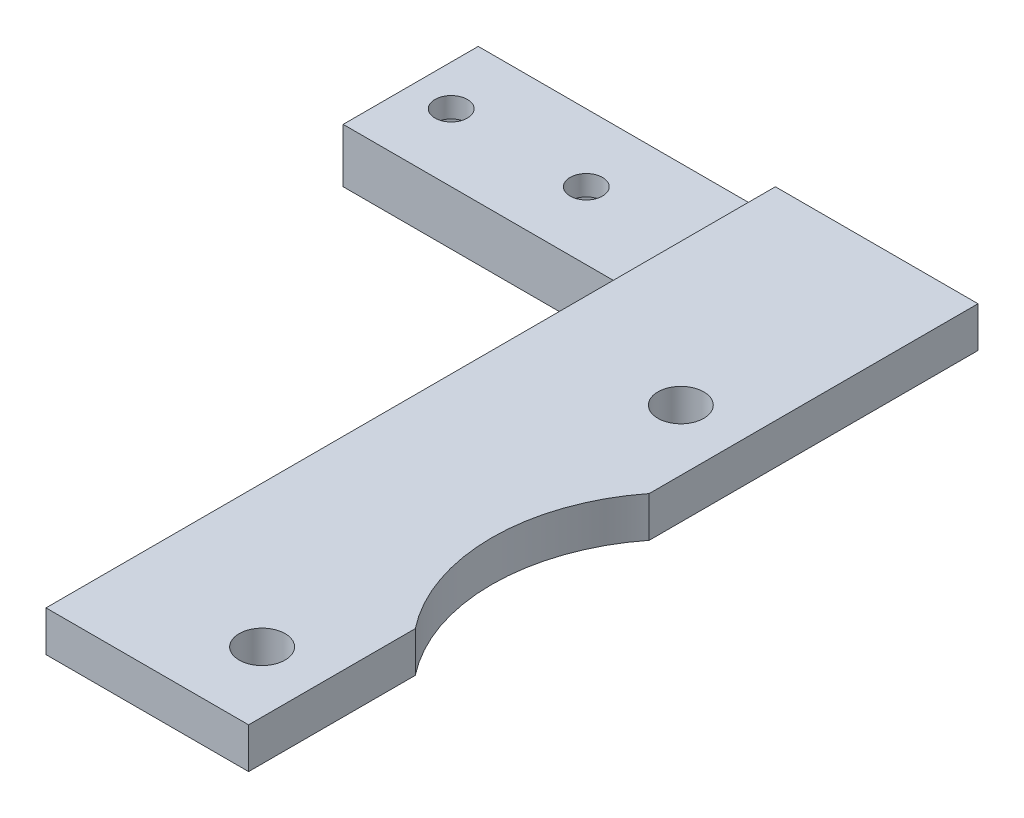
ISO-10303-21;
HEADER;
FILE_DESCRIPTION(('STEP AP214'),'2;1');
FILE_NAME('part.step','',(''),(''),'','','');
FILE_SCHEMA(('AUTOMOTIVE_DESIGN { 1 0 10303 214 1 1 1 1 }'));
ENDSEC;
DATA;
#1=APPLICATION_CONTEXT('core data for automotive mechanical design processes');
#2=APPLICATION_PROTOCOL_DEFINITION('international standard','automotive_design',2000,#1);
#3=PRODUCT_CONTEXT('',#1,'mechanical');
#4=PRODUCT('Part','Part','',(#3));
#5=PRODUCT_RELATED_PRODUCT_CATEGORY('part','',(#4));
#6=PRODUCT_DEFINITION_FORMATION('','',#4);
#7=PRODUCT_DEFINITION_CONTEXT('part definition',#1,'design');
#8=PRODUCT_DEFINITION('design','',#6,#7);
#9=PRODUCT_DEFINITION_SHAPE('','',#8);
#10=(LENGTH_UNIT() NAMED_UNIT(*) SI_UNIT(.MILLI.,.METRE.));
#11=(NAMED_UNIT(*) PLANE_ANGLE_UNIT() SI_UNIT($,.RADIAN.));
#12=(NAMED_UNIT(*) SI_UNIT($,.STERADIAN.) SOLID_ANGLE_UNIT());
#13=UNCERTAINTY_MEASURE_WITH_UNIT(LENGTH_MEASURE(1.E-05),#10,'distance_accuracy_value','');
#14=(GEOMETRIC_REPRESENTATION_CONTEXT(3) GLOBAL_UNCERTAINTY_ASSIGNED_CONTEXT((#13)) GLOBAL_UNIT_ASSIGNED_CONTEXT((#10,
#11,#12)) REPRESENTATION_CONTEXT('',''));
#15=CARTESIAN_POINT('',(0.,0.,0.));
#16=DIRECTION('',(0.,0.,1.));
#17=DIRECTION('',(1.,0.,0.));
#18=AXIS2_PLACEMENT_3D('',#15,#16,#17);
#19=CARTESIAN_POINT('',(3.,-1.,5.));
#20=DIRECTION('',(0.,1.,0.));
#21=DIRECTION('',(0.,0.,1.));
#22=AXIS2_PLACEMENT_3D('',#19,#20,#21);
#23=CYLINDRICAL_SURFACE('',#22,1.2);
#24=CARTESIAN_POINT('',(3.,4.,5.));
#25=DIRECTION('',(0.,1.,0.));
#26=DIRECTION('',(0.,0.,1.));
#27=AXIS2_PLACEMENT_3D('',#24,#25,#26);
#28=CIRCLE('',#27,1.2);
#29=CARTESIAN_POINT('',(3.,4.,6.2));
#30=VERTEX_POINT('',#29);
#31=EDGE_CURVE('E358',#30,#30,#28,.T.);
#32=ORIENTED_EDGE('',*,*,#31,.T.);
#33=EDGE_LOOP('',(#32));
#34=FACE_BOUND('',#33,.T.);
#35=CARTESIAN_POINT('',(3.,2.5,5.));
#36=DIRECTION('',(0.,-1.,0.));
#37=DIRECTION('',(0.,0.,-1.));
#38=AXIS2_PLACEMENT_3D('',#35,#36,#37);
#39=CIRCLE('',#38,1.2);
#40=CARTESIAN_POINT('',(3.,2.5,3.8));
#41=VERTEX_POINT('',#40);
#42=EDGE_CURVE('E43',#41,#41,#39,.F.);
#43=ORIENTED_EDGE('',*,*,#42,.F.);
#44=EDGE_LOOP('',(#43));
#45=FACE_BOUND('',#44,.T.);
#46=ADVANCED_FACE('F39',(#34,#45),#23,.F.);
#47=CARTESIAN_POINT('',(13.,-1.,5.));
#48=DIRECTION('',(0.,1.,0.));
#49=DIRECTION('',(0.,0.,1.));
#50=AXIS2_PLACEMENT_3D('',#47,#48,#49);
#51=CYLINDRICAL_SURFACE('',#50,1.2);
#52=CARTESIAN_POINT('',(13.,4.,5.));
#53=DIRECTION('',(0.,1.,0.));
#54=DIRECTION('',(0.,0.,1.));
#55=AXIS2_PLACEMENT_3D('',#52,#53,#54);
#56=CIRCLE('',#55,1.2);
#57=CARTESIAN_POINT('',(13.,4.,6.2));
#58=VERTEX_POINT('',#57);
#59=EDGE_CURVE('E353',#58,#58,#56,.T.);
#60=ORIENTED_EDGE('',*,*,#59,.T.);
#61=EDGE_LOOP('',(#60));
#62=FACE_BOUND('',#61,.T.);
#63=CARTESIAN_POINT('',(13.,2.5,5.));
#64=DIRECTION('',(0.,-1.,0.));
#65=DIRECTION('',(0.,0.,-1.));
#66=AXIS2_PLACEMENT_3D('',#63,#64,#65);
#67=CIRCLE('',#66,1.2);
#68=CARTESIAN_POINT('',(13.,2.5,3.8));
#69=VERTEX_POINT('',#68);
#70=EDGE_CURVE('E278',#69,#69,#67,.F.);
#71=ORIENTED_EDGE('',*,*,#70,.F.);
#72=EDGE_LOOP('',(#71));
#73=FACE_BOUND('',#72,.T.);
#74=ADVANCED_FACE('F527',(#62,#73),#51,.F.);
#75=CARTESIAN_POINT('',(37.,3.00000000000001,10.));
#76=DIRECTION('',(-1.,0.,0.));
#77=DIRECTION('',(0.,0.,1.));
#78=AXIS2_PLACEMENT_3D('',#75,#76,#77);
#79=PLANE('',#78);
#80=DIRECTION('',(0.,0.,-1.));
#81=VECTOR('',#80,1.);
#82=CARTESIAN_POINT('',(37.,3.00000000000001,10.));
#83=LINE('',#82,#81);
#84=CARTESIAN_POINT('',(37.,3.00000000000001,54.));
#85=VERTEX_POINT('',#84);
#86=CARTESIAN_POINT('',(37.,3.,41.6602540378444));
#87=VERTEX_POINT('',#86);
#88=EDGE_CURVE('E492',#85,#87,#83,.T.);
#89=ORIENTED_EDGE('',*,*,#88,.T.);
#90=DIRECTION('',(0.,1.,0.));
#91=VECTOR('',#90,1.);
#92=CARTESIAN_POINT('',(37.,-38.,41.6602540378444));
#93=LINE('',#92,#91);
#94=CARTESIAN_POINT('',(37.,6.00000000000001,41.6602540378444));
#95=VERTEX_POINT('',#94);
#96=EDGE_CURVE('E377',#87,#95,#93,.T.);
#97=ORIENTED_EDGE('',*,*,#96,.T.);
#98=DIRECTION('',(0.,0.,-1.));
#99=VECTOR('',#98,1.);
#100=CARTESIAN_POINT('',(37.,6.00000000000001,10.));
#101=LINE('',#100,#99);
#102=CARTESIAN_POINT('',(37.,6.,54.));
#103=VERTEX_POINT('',#102);
#104=EDGE_CURVE('E487',#103,#95,#101,.T.);
#105=ORIENTED_EDGE('',*,*,#104,.F.);
#106=DIRECTION('',(0.,1.,0.));
#107=VECTOR('',#106,1.);
#108=CARTESIAN_POINT('',(37.,3.00000000000001,54.));
#109=LINE('',#108,#107);
#110=EDGE_CURVE('E390',#85,#103,#109,.T.);
#111=ORIENTED_EDGE('',*,*,#110,.F.);
#112=EDGE_LOOP('',(#89,#97,#105,#111));
#113=FACE_BOUND('',#112,.T.);
#114=ADVANCED_FACE('F533',(#113),#79,.F.);
#115=CARTESIAN_POINT('',(21.,5.,10.));
#116=DIRECTION('',(0.,0.,-1.));
#117=DIRECTION('',(-1.,0.,0.));
#118=AXIS2_PLACEMENT_3D('',#115,#116,#117);
#119=PLANE('',#118);
#120=DIRECTION('',(1.,0.,0.));
#121=VECTOR('',#120,1.);
#122=CARTESIAN_POINT('',(37.,3.00000000000001,10.));
#123=LINE('',#122,#121);
#124=CARTESIAN_POINT('',(22.,3.,10.));
#125=VERTEX_POINT('',#124);
#126=CARTESIAN_POINT('',(26.,3.00000000000001,10.));
#127=VERTEX_POINT('',#126);
#128=EDGE_CURVE('E389',#125,#127,#123,.T.);
#129=ORIENTED_EDGE('',*,*,#128,.F.);
#130=DIRECTION('',(0.,-1.,0.));
#131=VECTOR('',#130,1.);
#132=CARTESIAN_POINT('',(22.,3.,10.));
#133=LINE('',#132,#131);
#134=CARTESIAN_POINT('',(22.,5.,10.));
#135=VERTEX_POINT('',#134);
#136=EDGE_CURVE('E49',#135,#125,#133,.T.);
#137=ORIENTED_EDGE('',*,*,#136,.F.);
#138=CARTESIAN_POINT('',(21.,5.,10.));
#139=DIRECTION('',(0.,0.,-1.));
#140=DIRECTION('',(-1.,0.,0.));
#141=AXIS2_PLACEMENT_3D('',#138,#139,#140);
#142=CIRCLE('',#141,1.);
#143=CARTESIAN_POINT('',(21.,4.,10.));
#144=VERTEX_POINT('',#143);
#145=EDGE_CURVE('E437',#135,#144,#142,.T.);
#146=ORIENTED_EDGE('',*,*,#145,.T.);
#147=DIRECTION('',(-1.,0.,0.));
#148=VECTOR('',#147,1.);
#149=CARTESIAN_POINT('',(0.,4.,10.));
#150=LINE('',#149,#148);
#151=CARTESIAN_POINT('',(0.,4.,10.));
#152=VERTEX_POINT('',#151);
#153=EDGE_CURVE('E417',#144,#152,#150,.T.);
#154=ORIENTED_EDGE('',*,*,#153,.T.);
#155=DIRECTION('',(0.,-1.,0.));
#156=VECTOR('',#155,1.);
#157=CARTESIAN_POINT('',(0.,4.,10.));
#158=LINE('',#157,#156);
#159=CARTESIAN_POINT('',(0.,0.,10.));
#160=VERTEX_POINT('',#159);
#161=EDGE_CURVE('E421',#152,#160,#158,.T.);
#162=ORIENTED_EDGE('',*,*,#161,.T.);
#163=DIRECTION('',(1.,0.,0.));
#164=VECTOR('',#163,1.);
#165=CARTESIAN_POINT('',(0.,0.,10.));
#166=LINE('',#165,#164);
#167=CARTESIAN_POINT('',(24.,0.,10.));
#168=VERTEX_POINT('',#167);
#169=EDGE_CURVE('E425',#160,#168,#166,.T.);
#170=ORIENTED_EDGE('',*,*,#169,.T.);
#171=CARTESIAN_POINT('',(24.,1.,10.));
#172=DIRECTION('',(0.,0.,1.));
#173=DIRECTION('',(-1.,0.,0.));
#174=AXIS2_PLACEMENT_3D('',#171,#172,#173);
#175=CIRCLE('',#174,1.);
#176=CARTESIAN_POINT('',(25.,1.,10.));
#177=VERTEX_POINT('',#176);
#178=EDGE_CURVE('E428',#168,#177,#175,.T.);
#179=ORIENTED_EDGE('',*,*,#178,.T.);
#180=DIRECTION('',(0.,1.,0.));
#181=VECTOR('',#180,1.);
#182=CARTESIAN_POINT('',(25.,1.,10.));
#183=LINE('',#182,#181);
#184=CARTESIAN_POINT('',(25.,2.00000000000001,10.));
#185=VERTEX_POINT('',#184);
#186=EDGE_CURVE('E431',#177,#185,#183,.T.);
#187=ORIENTED_EDGE('',*,*,#186,.T.);
#188=CARTESIAN_POINT('',(26.,2.00000000000001,10.));
#189=DIRECTION('',(0.,0.,-1.));
#190=DIRECTION('',(-1.,0.,0.));
#191=AXIS2_PLACEMENT_3D('',#188,#189,#190);
#192=CIRCLE('',#191,1.);
#193=EDGE_CURVE('E434',#185,#127,#192,.T.);
#194=ORIENTED_EDGE('',*,*,#193,.T.);
#195=EDGE_LOOP('',(#129,#137,#146,#154,#162,#170,#179,#187,#194));
#196=FACE_BOUND('',#195,.T.);
#197=ADVANCED_FACE('F556',(#196),#119,.F.);
#198=CARTESIAN_POINT('',(0.,4.,10.));
#199=DIRECTION('',(0.,-1.,0.));
#200=DIRECTION('',(0.,0.,-1.));
#201=AXIS2_PLACEMENT_3D('',#198,#199,#200);
#202=PLANE('',#201);
#203=ORIENTED_EDGE('',*,*,#59,.F.);
#204=EDGE_LOOP('',(#203));
#205=FACE_BOUND('',#204,.T.);
#206=ORIENTED_EDGE('',*,*,#31,.F.);
#207=EDGE_LOOP('',(#206));
#208=FACE_BOUND('',#207,.T.);
#209=DIRECTION('',(-1.,0.,0.));
#210=VECTOR('',#209,1.);
#211=CARTESIAN_POINT('',(0.,4.,0.));
#212=LINE('',#211,#210);
#213=CARTESIAN_POINT('',(21.,4.,0.));
#214=VERTEX_POINT('',#213);
#215=CARTESIAN_POINT('',(0.,4.,0.));
#216=VERTEX_POINT('',#215);
#217=EDGE_CURVE('E416',#214,#216,#212,.T.);
#218=ORIENTED_EDGE('',*,*,#217,.T.);
#219=DIRECTION('',(0.,0.,-1.));
#220=VECTOR('',#219,1.);
#221=CARTESIAN_POINT('',(0.,4.,10.));
#222=LINE('',#221,#220);
#223=EDGE_CURVE('E409',#152,#216,#222,.T.);
#224=ORIENTED_EDGE('',*,*,#223,.F.);
#225=ORIENTED_EDGE('',*,*,#153,.F.);
#226=DIRECTION('',(0.,0.,-1.));
#227=VECTOR('',#226,1.);
#228=CARTESIAN_POINT('',(21.,4.,10.));
#229=LINE('',#228,#227);
#230=EDGE_CURVE('E440',#144,#214,#229,.T.);
#231=ORIENTED_EDGE('',*,*,#230,.T.);
#232=EDGE_LOOP('',(#218,#224,#225,#231));
#233=FACE_BOUND('',#232,.T.);
#234=ADVANCED_FACE('F41',(#205,#208,#233),#202,.F.);
#235=CARTESIAN_POINT('',(0.,4.,10.));
#236=DIRECTION('',(1.,0.,0.));
#237=DIRECTION('',(0.,1.,0.));
#238=AXIS2_PLACEMENT_3D('',#235,#236,#237);
#239=PLANE('',#238);
#240=DIRECTION('',(0.,-1.,0.));
#241=VECTOR('',#240,1.);
#242=CARTESIAN_POINT('',(0.,4.,0.));
#243=LINE('',#242,#241);
#244=CARTESIAN_POINT('',(0.,0.,0.));
#245=VERTEX_POINT('',#244);
#246=EDGE_CURVE('E444',#216,#245,#243,.T.);
#247=ORIENTED_EDGE('',*,*,#246,.T.);
#248=DIRECTION('',(0.,0.,-1.));
#249=VECTOR('',#248,1.);
#250=CARTESIAN_POINT('',(0.,0.,10.));
#251=LINE('',#250,#249);
#252=EDGE_CURVE('E512',#160,#245,#251,.T.);
#253=ORIENTED_EDGE('',*,*,#252,.F.);
#254=ORIENTED_EDGE('',*,*,#161,.F.);
#255=ORIENTED_EDGE('',*,*,#223,.T.);
#256=EDGE_LOOP('',(#247,#253,#254,#255));
#257=FACE_BOUND('',#256,.T.);
#258=ADVANCED_FACE('F597',(#257),#239,.F.);
#259=CARTESIAN_POINT('',(0.,0.,10.));
#260=DIRECTION('',(0.,1.,0.));
#261=DIRECTION('',(0.,0.,1.));
#262=AXIS2_PLACEMENT_3D('',#259,#260,#261);
#263=PLANE('',#262);
#264=DIRECTION('',(-0.866025403784438,0.,-0.5));
#265=VECTOR('',#264,1.);
#266=CARTESIAN_POINT('',(3.,0.,7.25));
#267=LINE('',#266,#265);
#268=CARTESIAN_POINT('',(3.,0.,7.25));
#269=VERTEX_POINT('',#268);
#270=CARTESIAN_POINT('',(1.05144284148501,0.,6.125));
#271=VERTEX_POINT('',#270);
#272=EDGE_CURVE('E260',#269,#271,#267,.T.);
#273=ORIENTED_EDGE('',*,*,#272,.F.);
#274=DIRECTION('',(-0.866025403784438,0.,0.5));
#275=VECTOR('',#274,1.);
#276=CARTESIAN_POINT('',(4.94855715851499,0.,6.125));
#277=LINE('',#276,#275);
#278=CARTESIAN_POINT('',(4.94855715851499,0.,6.125));
#279=VERTEX_POINT('',#278);
#280=EDGE_CURVE('E57',#279,#269,#277,.T.);
#281=ORIENTED_EDGE('',*,*,#280,.F.);
#282=DIRECTION('',(0.,0.,1.));
#283=VECTOR('',#282,1.);
#284=CARTESIAN_POINT('',(4.94855715851499,0.,3.875));
#285=LINE('',#284,#283);
#286=CARTESIAN_POINT('',(4.94855715851499,0.,3.875));
#287=VERTEX_POINT('',#286);
#288=EDGE_CURVE('E240',#287,#279,#285,.T.);
#289=ORIENTED_EDGE('',*,*,#288,.F.);
#290=DIRECTION('',(0.866025403784439,0.,0.5));
#291=VECTOR('',#290,1.);
#292=CARTESIAN_POINT('',(3.,0.,2.75));
#293=LINE('',#292,#291);
#294=CARTESIAN_POINT('',(3.,0.,2.75));
#295=VERTEX_POINT('',#294);
#296=EDGE_CURVE('E244',#295,#287,#293,.T.);
#297=ORIENTED_EDGE('',*,*,#296,.F.);
#298=DIRECTION('',(0.866025403784438,0.,-0.5));
#299=VECTOR('',#298,1.);
#300=CARTESIAN_POINT('',(1.05144284148501,0.,3.875));
#301=LINE('',#300,#299);
#302=CARTESIAN_POINT('',(1.05144284148501,0.,3.875));
#303=VERTEX_POINT('',#302);
#304=EDGE_CURVE('E268',#303,#295,#301,.T.);
#305=ORIENTED_EDGE('',*,*,#304,.F.);
#306=DIRECTION('',(0.,0.,-1.));
#307=VECTOR('',#306,1.);
#308=CARTESIAN_POINT('',(1.05144284148501,0.,6.125));
#309=LINE('',#308,#307);
#310=EDGE_CURVE('E264',#271,#303,#309,.T.);
#311=ORIENTED_EDGE('',*,*,#310,.F.);
#312=EDGE_LOOP('',(#273,#281,#289,#297,#305,#311));
#313=FACE_BOUND('',#312,.T.);
#314=DIRECTION('',(-0.866025403784439,0.,-0.5));
#315=VECTOR('',#314,1.);
#316=CARTESIAN_POINT('',(13.,0.,7.25));
#317=LINE('',#316,#315);
#318=CARTESIAN_POINT('',(13.,0.,7.25));
#319=VERTEX_POINT('',#318);
#320=CARTESIAN_POINT('',(11.051442841485,0.,6.125));
#321=VERTEX_POINT('',#320);
#322=EDGE_CURVE('E318',#319,#321,#317,.T.);
#323=ORIENTED_EDGE('',*,*,#322,.F.);
#324=DIRECTION('',(-0.866025403784439,0.,0.5));
#325=VECTOR('',#324,1.);
#326=CARTESIAN_POINT('',(14.948557158515,0.,6.125));
#327=LINE('',#326,#325);
#328=CARTESIAN_POINT('',(14.948557158515,0.,6.125));
#329=VERTEX_POINT('',#328);
#330=EDGE_CURVE('E65',#329,#319,#327,.T.);
#331=ORIENTED_EDGE('',*,*,#330,.F.);
#332=DIRECTION('',(0.,0.,1.));
#333=VECTOR('',#332,1.);
#334=CARTESIAN_POINT('',(14.948557158515,0.,3.875));
#335=LINE('',#334,#333);
#336=CARTESIAN_POINT('',(14.948557158515,0.,3.875));
#337=VERTEX_POINT('',#336);
#338=EDGE_CURVE('E295',#337,#329,#335,.T.);
#339=ORIENTED_EDGE('',*,*,#338,.F.);
#340=DIRECTION('',(0.866025403784438,0.,0.5));
#341=VECTOR('',#340,1.);
#342=CARTESIAN_POINT('',(13.,0.,2.75));
#343=LINE('',#342,#341);
#344=CARTESIAN_POINT('',(13.,0.,2.75));
#345=VERTEX_POINT('',#344);
#346=EDGE_CURVE('E330',#345,#337,#343,.T.);
#347=ORIENTED_EDGE('',*,*,#346,.F.);
#348=DIRECTION('',(0.866025403784439,0.,-0.5));
#349=VECTOR('',#348,1.);
#350=CARTESIAN_POINT('',(11.051442841485,0.,3.875));
#351=LINE('',#350,#349);
#352=CARTESIAN_POINT('',(11.051442841485,0.,3.875));
#353=VERTEX_POINT('',#352);
#354=EDGE_CURVE('E326',#353,#345,#351,.T.);
#355=ORIENTED_EDGE('',*,*,#354,.F.);
#356=DIRECTION('',(0.,0.,-1.));
#357=VECTOR('',#356,1.);
#358=CARTESIAN_POINT('',(11.051442841485,0.,6.125));
#359=LINE('',#358,#357);
#360=EDGE_CURVE('E322',#321,#353,#359,.T.);
#361=ORIENTED_EDGE('',*,*,#360,.F.);
#362=EDGE_LOOP('',(#323,#331,#339,#347,#355,#361));
#363=FACE_BOUND('',#362,.T.);
#364=DIRECTION('',(1.,0.,0.));
#365=VECTOR('',#364,1.);
#366=CARTESIAN_POINT('',(0.,0.,0.));
#367=LINE('',#366,#365);
#368=CARTESIAN_POINT('',(24.,0.,0.));
#369=VERTEX_POINT('',#368);
#370=EDGE_CURVE('E447',#245,#369,#367,.T.);
#371=ORIENTED_EDGE('',*,*,#370,.T.);
#372=DIRECTION('',(0.,0.,-1.));
#373=VECTOR('',#372,1.);
#374=CARTESIAN_POINT('',(24.,0.,10.));
#375=LINE('',#374,#373);
#376=EDGE_CURVE('E508',#168,#369,#375,.T.);
#377=ORIENTED_EDGE('',*,*,#376,.F.);
#378=ORIENTED_EDGE('',*,*,#169,.F.);
#379=ORIENTED_EDGE('',*,*,#252,.T.);
#380=EDGE_LOOP('',(#371,#377,#378,#379));
#381=FACE_BOUND('',#380,.T.);
#382=ADVANCED_FACE('F594',(#313,#363,#381),#263,.F.);
#383=CARTESIAN_POINT('',(24.,1.,10.));
#384=DIRECTION('',(0.,0.,-1.));
#385=DIRECTION('',(-1.,0.,0.));
#386=AXIS2_PLACEMENT_3D('',#383,#384,#385);
#387=CYLINDRICAL_SURFACE('',#386,1.);
#388=CARTESIAN_POINT('',(24.,1.,0.));
#389=DIRECTION('',(0.,0.,1.));
#390=DIRECTION('',(-1.,0.,0.));
#391=AXIS2_PLACEMENT_3D('',#388,#389,#390);
#392=CIRCLE('',#391,1.);
#393=CARTESIAN_POINT('',(25.,1.,0.));
#394=VERTEX_POINT('',#393);
#395=EDGE_CURVE('E450',#369,#394,#392,.T.);
#396=ORIENTED_EDGE('',*,*,#395,.T.);
#397=DIRECTION('',(0.,0.,-1.));
#398=VECTOR('',#397,1.);
#399=CARTESIAN_POINT('',(25.,1.,10.));
#400=LINE('',#399,#398);
#401=EDGE_CURVE('E504',#177,#394,#400,.T.);
#402=ORIENTED_EDGE('',*,*,#401,.F.);
#403=ORIENTED_EDGE('',*,*,#178,.F.);
#404=ORIENTED_EDGE('',*,*,#376,.T.);
#405=EDGE_LOOP('',(#396,#402,#403,#404));
#406=FACE_BOUND('',#405,.T.);
#407=ADVANCED_FACE('F590',(#406),#387,.T.);
#408=CARTESIAN_POINT('',(25.,1.,10.));
#409=DIRECTION('',(-1.,0.,0.));
#410=DIRECTION('',(0.,0.,1.));
#411=AXIS2_PLACEMENT_3D('',#408,#409,#410);
#412=PLANE('',#411);
#413=DIRECTION('',(0.,1.,0.));
#414=VECTOR('',#413,1.);
#415=CARTESIAN_POINT('',(25.,1.,0.));
#416=LINE('',#415,#414);
#417=CARTESIAN_POINT('',(25.,2.00000000000001,0.));
#418=VERTEX_POINT('',#417);
#419=EDGE_CURVE('E453',#394,#418,#416,.T.);
#420=ORIENTED_EDGE('',*,*,#419,.T.);
#421=DIRECTION('',(0.,0.,-1.));
#422=VECTOR('',#421,1.);
#423=CARTESIAN_POINT('',(25.,2.00000000000001,10.));
#424=LINE('',#423,#422);
#425=EDGE_CURVE('E500',#185,#418,#424,.T.);
#426=ORIENTED_EDGE('',*,*,#425,.F.);
#427=ORIENTED_EDGE('',*,*,#186,.F.);
#428=ORIENTED_EDGE('',*,*,#401,.T.);
#429=EDGE_LOOP('',(#420,#426,#427,#428));
#430=FACE_BOUND('',#429,.T.);
#431=ADVANCED_FACE('F586',(#430),#412,.F.);
#432=CARTESIAN_POINT('',(26.,2.00000000000001,10.));
#433=DIRECTION('',(0.,0.,-1.));
#434=DIRECTION('',(-1.,0.,0.));
#435=AXIS2_PLACEMENT_3D('',#432,#433,#434);
#436=CYLINDRICAL_SURFACE('',#435,1.);
#437=CARTESIAN_POINT('',(26.,2.00000000000001,0.));
#438=DIRECTION('',(0.,0.,-1.));
#439=DIRECTION('',(-1.,0.,0.));
#440=AXIS2_PLACEMENT_3D('',#437,#438,#439);
#441=CIRCLE('',#440,1.);
#442=CARTESIAN_POINT('',(26.,3.00000000000001,0.));
#443=VERTEX_POINT('',#442);
#444=EDGE_CURVE('E456',#418,#443,#441,.T.);
#445=ORIENTED_EDGE('',*,*,#444,.T.);
#446=DIRECTION('',(0.,0.,-1.));
#447=VECTOR('',#446,1.);
#448=CARTESIAN_POINT('',(26.,3.00000000000001,10.));
#449=LINE('',#448,#447);
#450=EDGE_CURVE('E496',#127,#443,#449,.T.);
#451=ORIENTED_EDGE('',*,*,#450,.F.);
#452=ORIENTED_EDGE('',*,*,#193,.F.);
#453=ORIENTED_EDGE('',*,*,#425,.T.);
#454=EDGE_LOOP('',(#445,#451,#452,#453));
#455=FACE_BOUND('',#454,.T.);
#456=ADVANCED_FACE('F582',(#455),#436,.F.);
#457=CARTESIAN_POINT('',(26.,3.00000000000001,10.));
#458=DIRECTION('',(0.,1.,0.));
#459=DIRECTION('',(0.,0.,1.));
#460=AXIS2_PLACEMENT_3D('',#457,#458,#459);
#461=PLANE('',#460);
#462=CARTESIAN_POINT('',(32.5,3.,48.5));
#463=DIRECTION('',(0.,1.,0.));
#464=DIRECTION('',(0.,0.,1.));
#465=AXIS2_PLACEMENT_3D('',#462,#463,#464);
#466=CIRCLE('',#465,1.7);
#467=CARTESIAN_POINT('',(32.5,3.,50.2));
#468=VERTEX_POINT('',#467);
#469=EDGE_CURVE('E385',#468,#468,#466,.T.);
#470=ORIENTED_EDGE('',*,*,#469,.T.);
#471=EDGE_LOOP('',(#470));
#472=FACE_BOUND('',#471,.T.);
#473=CARTESIAN_POINT('',(32.5,3.,17.5));
#474=DIRECTION('',(0.,1.,0.));
#475=DIRECTION('',(0.,0.,1.));
#476=AXIS2_PLACEMENT_3D('',#473,#474,#475);
#477=CIRCLE('',#476,1.7);
#478=CARTESIAN_POINT('',(32.5,3.,19.2));
#479=VERTEX_POINT('',#478);
#480=EDGE_CURVE('E381',#479,#479,#477,.T.);
#481=ORIENTED_EDGE('',*,*,#480,.T.);
#482=EDGE_LOOP('',(#481));
#483=FACE_BOUND('',#482,.T.);
#484=CARTESIAN_POINT('',(37.,3.00000000000001,24.3397459621556));
#485=VERTEX_POINT('',#484);
#486=CARTESIAN_POINT('',(37.,3.00000000000001,0.));
#487=VERTEX_POINT('',#486);
#488=EDGE_CURVE('E491',#485,#487,#83,.T.);
#489=ORIENTED_EDGE('',*,*,#488,.F.);
#490=CARTESIAN_POINT('',(48.,3.,33.));
#491=DIRECTION('',(0.,1.,0.));
#492=DIRECTION('',(0.,0.,1.));
#493=AXIS2_PLACEMENT_3D('',#490,#491,#492);
#494=CIRCLE('',#493,14.);
#495=EDGE_CURVE('E373',#485,#87,#494,.T.);
#496=ORIENTED_EDGE('',*,*,#495,.T.);
#497=ORIENTED_EDGE('',*,*,#88,.F.);
#498=DIRECTION('',(1.,0.,0.));
#499=VECTOR('',#498,1.);
#500=CARTESIAN_POINT('',(37.,3.00000000000001,54.));
#501=LINE('',#500,#499);
#502=CARTESIAN_POINT('',(22.,3.,54.));
#503=VERTEX_POINT('',#502);
#504=EDGE_CURVE('E401',#503,#85,#501,.T.);
#505=ORIENTED_EDGE('',*,*,#504,.F.);
#506=DIRECTION('',(0.,0.,-1.));
#507=VECTOR('',#506,1.);
#508=CARTESIAN_POINT('',(22.,3.,54.));
#509=LINE('',#508,#507);
#510=EDGE_CURVE('E405',#503,#125,#509,.T.);
#511=ORIENTED_EDGE('',*,*,#510,.T.);
#512=ORIENTED_EDGE('',*,*,#128,.T.);
#513=ORIENTED_EDGE('',*,*,#450,.T.);
#514=DIRECTION('',(1.,0.,0.));
#515=VECTOR('',#514,1.);
#516=CARTESIAN_POINT('',(26.,3.00000000000001,0.));
#517=LINE('',#516,#515);
#518=EDGE_CURVE('E459',#443,#487,#517,.T.);
#519=ORIENTED_EDGE('',*,*,#518,.T.);
#520=EDGE_LOOP('',(#489,#496,#497,#505,#511,#512,#513,#519));
#521=FACE_BOUND('',#520,.T.);
#522=ADVANCED_FACE('F578',(#472,#483,#521),#461,.F.);
#523=CARTESIAN_POINT('',(37.,6.,24.3397459621556));
#524=VERTEX_POINT('',#523);
#525=CARTESIAN_POINT('',(37.,6.00000000000001,0.));
#526=VERTEX_POINT('',#525);
#527=EDGE_CURVE('E486',#524,#526,#101,.T.);
#528=ORIENTED_EDGE('',*,*,#527,.F.);
#529=DIRECTION('',(0.,1.,0.));
#530=VECTOR('',#529,1.);
#531=CARTESIAN_POINT('',(37.,-38.,24.3397459621556));
#532=LINE('',#531,#530);
#533=EDGE_CURVE('E366',#524,#485,#532,.F.);
#534=ORIENTED_EDGE('',*,*,#533,.T.);
#535=ORIENTED_EDGE('',*,*,#488,.T.);
#536=DIRECTION('',(0.,1.,0.));
#537=VECTOR('',#536,1.);
#538=CARTESIAN_POINT('',(37.,3.00000000000001,0.));
#539=LINE('',#538,#537);
#540=EDGE_CURVE('E463',#487,#526,#539,.T.);
#541=ORIENTED_EDGE('',*,*,#540,.T.);
#542=EDGE_LOOP('',(#528,#534,#535,#541));
#543=FACE_BOUND('',#542,.T.);
#544=ADVANCED_FACE('F574',(#543),#79,.F.);
#545=CARTESIAN_POINT('',(37.,6.00000000000001,10.));
#546=DIRECTION('',(0.,-1.,0.));
#547=DIRECTION('',(1.,0.,0.));
#548=AXIS2_PLACEMENT_3D('',#545,#546,#547);
#549=PLANE('',#548);
#550=CARTESIAN_POINT('',(32.5,6.,48.5));
#551=DIRECTION('',(0.,1.,0.));
#552=DIRECTION('',(-1.,0.,0.));
#553=AXIS2_PLACEMENT_3D('',#550,#551,#552);
#554=CIRCLE('',#553,1.7);
#555=CARTESIAN_POINT('',(30.8,6.,48.5));
#556=VERTEX_POINT('',#555);
#557=EDGE_CURVE('E357',#556,#556,#554,.T.);
#558=ORIENTED_EDGE('',*,*,#557,.F.);
#559=EDGE_LOOP('',(#558));
#560=FACE_BOUND('',#559,.T.);
#561=CARTESIAN_POINT('',(32.5,6.,17.5));
#562=DIRECTION('',(0.,1.,0.));
#563=DIRECTION('',(-1.,0.,0.));
#564=AXIS2_PLACEMENT_3D('',#561,#562,#563);
#565=CIRCLE('',#564,1.7);
#566=CARTESIAN_POINT('',(30.8,6.,17.5));
#567=VERTEX_POINT('',#566);
#568=EDGE_CURVE('E362',#567,#567,#565,.T.);
#569=ORIENTED_EDGE('',*,*,#568,.F.);
#570=EDGE_LOOP('',(#569));
#571=FACE_BOUND('',#570,.T.);
#572=ORIENTED_EDGE('',*,*,#104,.T.);
#573=CARTESIAN_POINT('',(48.,6.00000000000001,33.));
#574=DIRECTION('',(0.,-1.,0.));
#575=DIRECTION('',(1.,0.,0.));
#576=AXIS2_PLACEMENT_3D('',#573,#574,#575);
#577=CIRCLE('',#576,14.);
#578=EDGE_CURVE('E11',#95,#524,#577,.T.);
#579=ORIENTED_EDGE('',*,*,#578,.T.);
#580=ORIENTED_EDGE('',*,*,#527,.T.);
#581=DIRECTION('',(-1.,0.,0.));
#582=VECTOR('',#581,1.);
#583=CARTESIAN_POINT('',(37.,6.00000000000001,0.));
#584=LINE('',#583,#582);
#585=CARTESIAN_POINT('',(22.,6.,0.));
#586=VERTEX_POINT('',#585);
#587=EDGE_CURVE('E467',#526,#586,#584,.T.);
#588=ORIENTED_EDGE('',*,*,#587,.T.);
#589=DIRECTION('',(0.,0.,-1.));
#590=VECTOR('',#589,1.);
#591=CARTESIAN_POINT('',(22.,6.,10.));
#592=LINE('',#591,#590);
#593=CARTESIAN_POINT('',(22.,6.,54.));
#594=VERTEX_POINT('',#593);
#595=EDGE_CURVE('E482',#594,#586,#592,.T.);
#596=ORIENTED_EDGE('',*,*,#595,.F.);
#597=DIRECTION('',(-1.,0.,0.));
#598=VECTOR('',#597,1.);
#599=CARTESIAN_POINT('',(37.,6.,54.));
#600=LINE('',#599,#598);
#601=EDGE_CURVE('E394',#103,#594,#600,.T.);
#602=ORIENTED_EDGE('',*,*,#601,.F.);
#603=EDGE_LOOP('',(#572,#579,#580,#588,#596,#602));
#604=FACE_BOUND('',#603,.T.);
#605=ADVANCED_FACE('F570',(#560,#571,#604),#549,.F.);
#606=CARTESIAN_POINT('',(22.,5.,10.));
#607=DIRECTION('',(1.,0.,0.));
#608=DIRECTION('',(0.,0.,-1.));
#609=AXIS2_PLACEMENT_3D('',#606,#607,#608);
#610=PLANE('',#609);
#611=DIRECTION('',(0.,-1.,0.));
#612=VECTOR('',#611,1.);
#613=CARTESIAN_POINT('',(22.,5.,0.));
#614=LINE('',#613,#612);
#615=CARTESIAN_POINT('',(22.,5.,0.));
#616=VERTEX_POINT('',#615);
#617=EDGE_CURVE('E470',#586,#616,#614,.T.);
#618=ORIENTED_EDGE('',*,*,#617,.T.);
#619=DIRECTION('',(0.,0.,-1.));
#620=VECTOR('',#619,1.);
#621=CARTESIAN_POINT('',(22.,5.,10.));
#622=LINE('',#621,#620);
#623=EDGE_CURVE('E478',#135,#616,#622,.T.);
#624=ORIENTED_EDGE('',*,*,#623,.F.);
#625=ORIENTED_EDGE('',*,*,#136,.T.);
#626=ORIENTED_EDGE('',*,*,#510,.F.);
#627=DIRECTION('',(0.,-1.,0.));
#628=VECTOR('',#627,1.);
#629=CARTESIAN_POINT('',(22.,3.,54.));
#630=LINE('',#629,#628);
#631=EDGE_CURVE('E398',#594,#503,#630,.T.);
#632=ORIENTED_EDGE('',*,*,#631,.F.);
#633=ORIENTED_EDGE('',*,*,#595,.T.);
#634=EDGE_LOOP('',(#618,#624,#625,#626,#632,#633));
#635=FACE_BOUND('',#634,.T.);
#636=ADVANCED_FACE('F566',(#635),#610,.F.);
#637=CARTESIAN_POINT('',(21.,5.,10.));
#638=DIRECTION('',(0.,0.,-1.));
#639=DIRECTION('',(-1.,0.,0.));
#640=AXIS2_PLACEMENT_3D('',#637,#638,#639);
#641=CYLINDRICAL_SURFACE('',#640,1.);
#642=CARTESIAN_POINT('',(21.,5.,0.));
#643=DIRECTION('',(0.,0.,-1.));
#644=DIRECTION('',(-1.,0.,0.));
#645=AXIS2_PLACEMENT_3D('',#642,#643,#644);
#646=CIRCLE('',#645,1.);
#647=EDGE_CURVE('E422',#616,#214,#646,.T.);
#648=ORIENTED_EDGE('',*,*,#647,.T.);
#649=ORIENTED_EDGE('',*,*,#230,.F.);
#650=ORIENTED_EDGE('',*,*,#145,.F.);
#651=ORIENTED_EDGE('',*,*,#623,.T.);
#652=EDGE_LOOP('',(#648,#649,#650,#651));
#653=FACE_BOUND('',#652,.T.);
#654=ADVANCED_FACE('F562',(#653),#641,.F.);
#655=CARTESIAN_POINT('',(21.,5.,0.));
#656=DIRECTION('',(0.,0.,-1.));
#657=DIRECTION('',(-1.,0.,0.));
#658=AXIS2_PLACEMENT_3D('',#655,#656,#657);
#659=PLANE('',#658);
#660=ORIENTED_EDGE('',*,*,#217,.F.);
#661=ORIENTED_EDGE('',*,*,#647,.F.);
#662=ORIENTED_EDGE('',*,*,#617,.F.);
#663=ORIENTED_EDGE('',*,*,#587,.F.);
#664=ORIENTED_EDGE('',*,*,#540,.F.);
#665=ORIENTED_EDGE('',*,*,#518,.F.);
#666=ORIENTED_EDGE('',*,*,#444,.F.);
#667=ORIENTED_EDGE('',*,*,#419,.F.);
#668=ORIENTED_EDGE('',*,*,#395,.F.);
#669=ORIENTED_EDGE('',*,*,#370,.F.);
#670=ORIENTED_EDGE('',*,*,#246,.F.);
#671=EDGE_LOOP('',(#660,#661,#662,#663,#664,#665,#666,#667,#668,#669,#670));
#672=FACE_BOUND('',#671,.T.);
#673=ADVANCED_FACE('F554',(#672),#659,.T.);
#674=CARTESIAN_POINT('',(0.,0.,54.));
#675=DIRECTION('',(0.,0.,1.));
#676=DIRECTION('',(1.,0.,0.));
#677=AXIS2_PLACEMENT_3D('',#674,#675,#676);
#678=PLANE('',#677);
#679=ORIENTED_EDGE('',*,*,#110,.T.);
#680=ORIENTED_EDGE('',*,*,#601,.T.);
#681=ORIENTED_EDGE('',*,*,#631,.T.);
#682=ORIENTED_EDGE('',*,*,#504,.T.);
#683=EDGE_LOOP('',(#679,#680,#681,#682));
#684=FACE_BOUND('',#683,.T.);
#685=ADVANCED_FACE('F550',(#684),#678,.T.);
#686=CARTESIAN_POINT('',(48.,-38.,33.));
#687=DIRECTION('',(0.,1.,0.));
#688=DIRECTION('',(-1.,0.,0.));
#689=AXIS2_PLACEMENT_3D('',#686,#687,#688);
#690=CYLINDRICAL_SURFACE('',#689,14.);
#691=ORIENTED_EDGE('',*,*,#495,.F.);
#692=ORIENTED_EDGE('',*,*,#533,.F.);
#693=ORIENTED_EDGE('',*,*,#578,.F.);
#694=ORIENTED_EDGE('',*,*,#96,.F.);
#695=EDGE_LOOP('',(#691,#692,#693,#694));
#696=FACE_BOUND('',#695,.T.);
#697=ADVANCED_FACE('F542',(#696),#690,.F.);
#698=CARTESIAN_POINT('',(32.5,-38.,17.5));
#699=DIRECTION('',(0.,1.,0.));
#700=DIRECTION('',(-1.,0.,0.));
#701=AXIS2_PLACEMENT_3D('',#698,#699,#700);
#702=CYLINDRICAL_SURFACE('',#701,1.7);
#703=ORIENTED_EDGE('',*,*,#568,.T.);
#704=EDGE_LOOP('',(#703));
#705=FACE_BOUND('',#704,.T.);
#706=ORIENTED_EDGE('',*,*,#480,.F.);
#707=EDGE_LOOP('',(#706));
#708=FACE_BOUND('',#707,.T.);
#709=ADVANCED_FACE('F538',(#705,#708),#702,.F.);
#710=CARTESIAN_POINT('',(32.5,-38.,48.5));
#711=DIRECTION('',(0.,1.,0.));
#712=DIRECTION('',(-1.,0.,0.));
#713=AXIS2_PLACEMENT_3D('',#710,#711,#712);
#714=CYLINDRICAL_SURFACE('',#713,1.7);
#715=ORIENTED_EDGE('',*,*,#557,.T.);
#716=EDGE_LOOP('',(#715));
#717=FACE_BOUND('',#716,.T.);
#718=ORIENTED_EDGE('',*,*,#469,.F.);
#719=EDGE_LOOP('',(#718));
#720=FACE_BOUND('',#719,.T.);
#721=ADVANCED_FACE('F541',(#717,#720),#714,.F.);
#722=CARTESIAN_POINT('',(0.,2.5,0.));
#723=DIRECTION('',(0.,-1.,0.));
#724=DIRECTION('',(0.,0.,-1.));
#725=AXIS2_PLACEMENT_3D('',#722,#723,#724);
#726=PLANE('',#725);
#727=DIRECTION('',(-0.866025403784439,0.,0.5));
#728=VECTOR('',#727,1.);
#729=CARTESIAN_POINT('',(14.948557158515,2.5,6.125));
#730=LINE('',#729,#728);
#731=CARTESIAN_POINT('',(14.948557158515,2.5,6.125));
#732=VERTEX_POINT('',#731);
#733=CARTESIAN_POINT('',(13.,2.5,7.25));
#734=VERTEX_POINT('',#733);
#735=EDGE_CURVE('E290',#732,#734,#730,.T.);
#736=ORIENTED_EDGE('',*,*,#735,.T.);
#737=DIRECTION('',(-0.866025403784439,0.,-0.5));
#738=VECTOR('',#737,1.);
#739=CARTESIAN_POINT('',(13.,2.5,7.25));
#740=LINE('',#739,#738);
#741=CARTESIAN_POINT('',(11.051442841485,2.5,6.125));
#742=VERTEX_POINT('',#741);
#743=EDGE_CURVE('E294',#734,#742,#740,.T.);
#744=ORIENTED_EDGE('',*,*,#743,.T.);
#745=DIRECTION('',(0.,0.,-1.));
#746=VECTOR('',#745,1.);
#747=CARTESIAN_POINT('',(11.051442841485,2.5,6.125));
#748=LINE('',#747,#746);
#749=CARTESIAN_POINT('',(11.051442841485,2.5,3.875));
#750=VERTEX_POINT('',#749);
#751=EDGE_CURVE('E299',#742,#750,#748,.T.);
#752=ORIENTED_EDGE('',*,*,#751,.T.);
#753=DIRECTION('',(0.866025403784439,0.,-0.5));
#754=VECTOR('',#753,1.);
#755=CARTESIAN_POINT('',(11.051442841485,2.5,3.875));
#756=LINE('',#755,#754);
#757=CARTESIAN_POINT('',(13.,2.5,2.75));
#758=VERTEX_POINT('',#757);
#759=EDGE_CURVE('E303',#750,#758,#756,.T.);
#760=ORIENTED_EDGE('',*,*,#759,.T.);
#761=DIRECTION('',(0.866025403784438,0.,0.5));
#762=VECTOR('',#761,1.);
#763=CARTESIAN_POINT('',(13.,2.5,2.75));
#764=LINE('',#763,#762);
#765=CARTESIAN_POINT('',(14.948557158515,2.5,3.875));
#766=VERTEX_POINT('',#765);
#767=EDGE_CURVE('E307',#758,#766,#764,.T.);
#768=ORIENTED_EDGE('',*,*,#767,.T.);
#769=DIRECTION('',(0.,0.,1.));
#770=VECTOR('',#769,1.);
#771=CARTESIAN_POINT('',(14.948557158515,2.5,3.875));
#772=LINE('',#771,#770);
#773=EDGE_CURVE('E311',#766,#732,#772,.T.);
#774=ORIENTED_EDGE('',*,*,#773,.T.);
#775=EDGE_LOOP('',(#736,#744,#752,#760,#768,#774));
#776=FACE_BOUND('',#775,.T.);
#777=ORIENTED_EDGE('',*,*,#70,.T.);
#778=EDGE_LOOP('',(#777));
#779=FACE_BOUND('',#778,.T.);
#780=ADVANCED_FACE('F546',(#776,#779),#726,.T.);
#781=CARTESIAN_POINT('',(14.948557158515,2.5,6.125));
#782=DIRECTION('',(0.5,0.,0.866025403784439));
#783=DIRECTION('',(0.866025403784439,0.,-0.5));
#784=AXIS2_PLACEMENT_3D('',#781,#782,#783);
#785=PLANE('',#784);
#786=ORIENTED_EDGE('',*,*,#330,.T.);
#787=DIRECTION('',(0.,-1.,0.));
#788=VECTOR('',#787,1.);
#789=CARTESIAN_POINT('',(13.,2.5,7.25));
#790=LINE('',#789,#788);
#791=EDGE_CURVE('E315',#734,#319,#790,.T.);
#792=ORIENTED_EDGE('',*,*,#791,.F.);
#793=ORIENTED_EDGE('',*,*,#735,.F.);
#794=DIRECTION('',(0.,-1.,0.));
#795=VECTOR('',#794,1.);
#796=CARTESIAN_POINT('',(14.948557158515,2.5,6.125));
#797=LINE('',#796,#795);
#798=EDGE_CURVE('E261',#732,#329,#797,.T.);
#799=ORIENTED_EDGE('',*,*,#798,.T.);
#800=EDGE_LOOP('',(#786,#792,#793,#799));
#801=FACE_BOUND('',#800,.T.);
#802=ADVANCED_FACE('F689',(#801),#785,.F.);
#803=CARTESIAN_POINT('',(14.948557158515,2.5,3.875));
#804=DIRECTION('',(1.,0.,0.));
#805=DIRECTION('',(0.,0.,-1.));
#806=AXIS2_PLACEMENT_3D('',#803,#804,#805);
#807=PLANE('',#806);
#808=ORIENTED_EDGE('',*,*,#338,.T.);
#809=ORIENTED_EDGE('',*,*,#798,.F.);
#810=ORIENTED_EDGE('',*,*,#773,.F.);
#811=DIRECTION('',(0.,-1.,0.));
#812=VECTOR('',#811,1.);
#813=CARTESIAN_POINT('',(14.948557158515,2.5,3.875));
#814=LINE('',#813,#812);
#815=EDGE_CURVE('E339',#766,#337,#814,.T.);
#816=ORIENTED_EDGE('',*,*,#815,.T.);
#817=EDGE_LOOP('',(#808,#809,#810,#816));
#818=FACE_BOUND('',#817,.T.);
#819=ADVANCED_FACE('F699',(#818),#807,.F.);
#820=CARTESIAN_POINT('',(13.,2.5,2.75));
#821=DIRECTION('',(0.5,0.,-0.866025403784438));
#822=DIRECTION('',(-0.866025403784439,0.,-0.5));
#823=AXIS2_PLACEMENT_3D('',#820,#821,#822);
#824=PLANE('',#823);
#825=ORIENTED_EDGE('',*,*,#346,.T.);
#826=ORIENTED_EDGE('',*,*,#815,.F.);
#827=ORIENTED_EDGE('',*,*,#767,.F.);
#828=DIRECTION('',(0.,-1.,0.));
#829=VECTOR('',#828,1.);
#830=CARTESIAN_POINT('',(13.,2.5,2.75));
#831=LINE('',#830,#829);
#832=EDGE_CURVE('E342',#758,#345,#831,.T.);
#833=ORIENTED_EDGE('',*,*,#832,.T.);
#834=EDGE_LOOP('',(#825,#826,#827,#833));
#835=FACE_BOUND('',#834,.T.);
#836=ADVANCED_FACE('F707',(#835),#824,.F.);
#837=CARTESIAN_POINT('',(11.051442841485,2.5,3.875));
#838=DIRECTION('',(-0.5,0.,-0.866025403784439));
#839=DIRECTION('',(-0.866025403784439,0.,0.5));
#840=AXIS2_PLACEMENT_3D('',#837,#838,#839);
#841=PLANE('',#840);
#842=ORIENTED_EDGE('',*,*,#354,.T.);
#843=ORIENTED_EDGE('',*,*,#832,.F.);
#844=ORIENTED_EDGE('',*,*,#759,.F.);
#845=DIRECTION('',(0.,-1.,0.));
#846=VECTOR('',#845,1.);
#847=CARTESIAN_POINT('',(11.051442841485,2.5,3.875));
#848=LINE('',#847,#846);
#849=EDGE_CURVE('E345',#750,#353,#848,.T.);
#850=ORIENTED_EDGE('',*,*,#849,.T.);
#851=EDGE_LOOP('',(#842,#843,#844,#850));
#852=FACE_BOUND('',#851,.T.);
#853=ADVANCED_FACE('F717',(#852),#841,.F.);
#854=CARTESIAN_POINT('',(11.051442841485,2.5,6.125));
#855=DIRECTION('',(-1.,0.,0.));
#856=DIRECTION('',(0.,0.,1.));
#857=AXIS2_PLACEMENT_3D('',#854,#855,#856);
#858=PLANE('',#857);
#859=ORIENTED_EDGE('',*,*,#360,.T.);
#860=ORIENTED_EDGE('',*,*,#849,.F.);
#861=ORIENTED_EDGE('',*,*,#751,.F.);
#862=DIRECTION('',(0.,-1.,0.));
#863=VECTOR('',#862,1.);
#864=CARTESIAN_POINT('',(11.051442841485,2.5,6.125));
#865=LINE('',#864,#863);
#866=EDGE_CURVE('E348',#742,#321,#865,.T.);
#867=ORIENTED_EDGE('',*,*,#866,.T.);
#868=EDGE_LOOP('',(#859,#860,#861,#867));
#869=FACE_BOUND('',#868,.T.);
#870=ADVANCED_FACE('F727',(#869),#858,.F.);
#871=CARTESIAN_POINT('',(13.,2.5,7.25));
#872=DIRECTION('',(-0.5,0.,0.866025403784438));
#873=DIRECTION('',(0.866025403784439,0.,0.5));
#874=AXIS2_PLACEMENT_3D('',#871,#872,#873);
#875=PLANE('',#874);
#876=ORIENTED_EDGE('',*,*,#322,.T.);
#877=ORIENTED_EDGE('',*,*,#866,.F.);
#878=ORIENTED_EDGE('',*,*,#743,.F.);
#879=ORIENTED_EDGE('',*,*,#791,.T.);
#880=EDGE_LOOP('',(#876,#877,#878,#879));
#881=FACE_BOUND('',#880,.T.);
#882=ADVANCED_FACE('F737',(#881),#875,.F.);
#883=CARTESIAN_POINT('',(0.,2.5,0.));
#884=DIRECTION('',(0.,-1.,0.));
#885=DIRECTION('',(0.,0.,-1.));
#886=AXIS2_PLACEMENT_3D('',#883,#884,#885);
#887=PLANE('',#886);
#888=DIRECTION('',(-0.866025403784438,0.,0.5));
#889=VECTOR('',#888,1.);
#890=CARTESIAN_POINT('',(4.94855715851499,2.5,6.125));
#891=LINE('',#890,#889);
#892=CARTESIAN_POINT('',(4.94855715851499,2.5,6.125));
#893=VERTEX_POINT('',#892);
#894=CARTESIAN_POINT('',(3.,2.5,7.25));
#895=VERTEX_POINT('',#894);
#896=EDGE_CURVE('E217',#893,#895,#891,.T.);
#897=ORIENTED_EDGE('',*,*,#896,.T.);
#898=DIRECTION('',(-0.866025403784438,0.,-0.5));
#899=VECTOR('',#898,1.);
#900=CARTESIAN_POINT('',(3.,2.5,7.25));
#901=LINE('',#900,#899);
#902=CARTESIAN_POINT('',(1.05144284148501,2.5,6.125));
#903=VERTEX_POINT('',#902);
#904=EDGE_CURVE('E227',#895,#903,#901,.T.);
#905=ORIENTED_EDGE('',*,*,#904,.T.);
#906=DIRECTION('',(0.,0.,-1.));
#907=VECTOR('',#906,1.);
#908=CARTESIAN_POINT('',(1.05144284148501,2.5,6.125));
#909=LINE('',#908,#907);
#910=CARTESIAN_POINT('',(1.05144284148501,2.5,3.875));
#911=VERTEX_POINT('',#910);
#912=EDGE_CURVE('E233',#903,#911,#909,.T.);
#913=ORIENTED_EDGE('',*,*,#912,.T.);
#914=DIRECTION('',(0.866025403784438,0.,-0.5));
#915=VECTOR('',#914,1.);
#916=CARTESIAN_POINT('',(1.05144284148501,2.5,3.875));
#917=LINE('',#916,#915);
#918=CARTESIAN_POINT('',(3.,2.5,2.75));
#919=VERTEX_POINT('',#918);
#920=EDGE_CURVE('E249',#911,#919,#917,.T.);
#921=ORIENTED_EDGE('',*,*,#920,.T.);
#922=DIRECTION('',(0.866025403784439,0.,0.5));
#923=VECTOR('',#922,1.);
#924=CARTESIAN_POINT('',(3.,2.5,2.75));
#925=LINE('',#924,#923);
#926=CARTESIAN_POINT('',(4.94855715851499,2.5,3.875));
#927=VERTEX_POINT('',#926);
#928=EDGE_CURVE('E253',#919,#927,#925,.T.);
#929=ORIENTED_EDGE('',*,*,#928,.T.);
#930=DIRECTION('',(0.,0.,1.));
#931=VECTOR('',#930,1.);
#932=CARTESIAN_POINT('',(4.94855715851499,2.5,3.875));
#933=LINE('',#932,#931);
#934=EDGE_CURVE('E224',#927,#893,#933,.T.);
#935=ORIENTED_EDGE('',*,*,#934,.T.);
#936=EDGE_LOOP('',(#897,#905,#913,#921,#929,#935));
#937=FACE_BOUND('',#936,.T.);
#938=ORIENTED_EDGE('',*,*,#42,.T.);
#939=EDGE_LOOP('',(#938));
#940=FACE_BOUND('',#939,.T.);
#941=ADVANCED_FACE('F235',(#937,#940),#887,.T.);
#942=CARTESIAN_POINT('',(4.94855715851499,2.5,6.125));
#943=DIRECTION('',(0.5,0.,0.866025403784439));
#944=DIRECTION('',(0.866025403784439,0.,-0.5));
#945=AXIS2_PLACEMENT_3D('',#942,#943,#944);
#946=PLANE('',#945);
#947=ORIENTED_EDGE('',*,*,#280,.T.);
#948=DIRECTION('',(0.,-1.,0.));
#949=VECTOR('',#948,1.);
#950=CARTESIAN_POINT('',(3.,2.5,7.25));
#951=LINE('',#950,#949);
#952=EDGE_CURVE('E213',#895,#269,#951,.T.);
#953=ORIENTED_EDGE('',*,*,#952,.F.);
#954=ORIENTED_EDGE('',*,*,#896,.F.);
#955=DIRECTION('',(0.,-1.,0.));
#956=VECTOR('',#955,1.);
#957=CARTESIAN_POINT('',(4.94855715851499,2.5,6.125));
#958=LINE('',#957,#956);
#959=EDGE_CURVE('E275',#893,#279,#958,.T.);
#960=ORIENTED_EDGE('',*,*,#959,.T.);
#961=EDGE_LOOP('',(#947,#953,#954,#960));
#962=FACE_BOUND('',#961,.T.);
#963=ADVANCED_FACE('F215',(#962),#946,.F.);
#964=CARTESIAN_POINT('',(4.94855715851499,2.5,3.875));
#965=DIRECTION('',(1.,0.,0.));
#966=DIRECTION('',(0.,0.,-1.));
#967=AXIS2_PLACEMENT_3D('',#964,#965,#966);
#968=PLANE('',#967);
#969=ORIENTED_EDGE('',*,*,#288,.T.);
#970=ORIENTED_EDGE('',*,*,#959,.F.);
#971=ORIENTED_EDGE('',*,*,#934,.F.);
#972=DIRECTION('',(0.,-1.,0.));
#973=VECTOR('',#972,1.);
#974=CARTESIAN_POINT('',(4.94855715851499,2.5,3.875));
#975=LINE('',#974,#973);
#976=EDGE_CURVE('E279',#927,#287,#975,.T.);
#977=ORIENTED_EDGE('',*,*,#976,.T.);
#978=EDGE_LOOP('',(#969,#970,#971,#977));
#979=FACE_BOUND('',#978,.T.);
#980=ADVANCED_FACE('F764',(#979),#968,.F.);
#981=CARTESIAN_POINT('',(3.,2.5,2.75));
#982=DIRECTION('',(0.5,0.,-0.866025403784439));
#983=DIRECTION('',(-0.866025403784439,0.,-0.5));
#984=AXIS2_PLACEMENT_3D('',#981,#982,#983);
#985=PLANE('',#984);
#986=ORIENTED_EDGE('',*,*,#296,.T.);
#987=ORIENTED_EDGE('',*,*,#976,.F.);
#988=ORIENTED_EDGE('',*,*,#928,.F.);
#989=DIRECTION('',(0.,-1.,0.));
#990=VECTOR('',#989,1.);
#991=CARTESIAN_POINT('',(3.,2.5,2.75));
#992=LINE('',#991,#990);
#993=EDGE_CURVE('E282',#919,#295,#992,.T.);
#994=ORIENTED_EDGE('',*,*,#993,.T.);
#995=EDGE_LOOP('',(#986,#987,#988,#994));
#996=FACE_BOUND('',#995,.T.);
#997=ADVANCED_FACE('F773',(#996),#985,.F.);
#998=CARTESIAN_POINT('',(1.05144284148501,2.5,3.875));
#999=DIRECTION('',(-0.5,0.,-0.866025403784438));
#1000=DIRECTION('',(-0.866025403784439,0.,0.5));
#1001=AXIS2_PLACEMENT_3D('',#998,#999,#1000);
#1002=PLANE('',#1001);
#1003=ORIENTED_EDGE('',*,*,#304,.T.);
#1004=ORIENTED_EDGE('',*,*,#993,.F.);
#1005=ORIENTED_EDGE('',*,*,#920,.F.);
#1006=DIRECTION('',(0.,-1.,0.));
#1007=VECTOR('',#1006,1.);
#1008=CARTESIAN_POINT('',(1.05144284148501,2.5,3.875));
#1009=LINE('',#1008,#1007);
#1010=EDGE_CURVE('E285',#911,#303,#1009,.T.);
#1011=ORIENTED_EDGE('',*,*,#1010,.T.);
#1012=EDGE_LOOP('',(#1003,#1004,#1005,#1011));
#1013=FACE_BOUND('',#1012,.T.);
#1014=ADVANCED_FACE('F783',(#1013),#1002,.F.);
#1015=CARTESIAN_POINT('',(1.05144284148501,2.5,6.125));
#1016=DIRECTION('',(-1.,0.,0.));
#1017=DIRECTION('',(0.,0.,1.));
#1018=AXIS2_PLACEMENT_3D('',#1015,#1016,#1017);
#1019=PLANE('',#1018);
#1020=ORIENTED_EDGE('',*,*,#310,.T.);
#1021=ORIENTED_EDGE('',*,*,#1010,.F.);
#1022=ORIENTED_EDGE('',*,*,#912,.F.);
#1023=DIRECTION('',(0.,-1.,0.));
#1024=VECTOR('',#1023,1.);
#1025=CARTESIAN_POINT('',(1.05144284148501,2.5,6.125));
#1026=LINE('',#1025,#1024);
#1027=EDGE_CURVE('E223',#903,#271,#1026,.T.);
#1028=ORIENTED_EDGE('',*,*,#1027,.T.);
#1029=EDGE_LOOP('',(#1020,#1021,#1022,#1028));
#1030=FACE_BOUND('',#1029,.T.);
#1031=ADVANCED_FACE('F793',(#1030),#1019,.F.);
#1032=CARTESIAN_POINT('',(3.,2.5,7.25));
#1033=DIRECTION('',(-0.5,0.,0.866025403784439));
#1034=DIRECTION('',(0.866025403784439,0.,0.5));
#1035=AXIS2_PLACEMENT_3D('',#1032,#1033,#1034);
#1036=PLANE('',#1035);
#1037=ORIENTED_EDGE('',*,*,#272,.T.);
#1038=ORIENTED_EDGE('',*,*,#1027,.F.);
#1039=ORIENTED_EDGE('',*,*,#904,.F.);
#1040=ORIENTED_EDGE('',*,*,#952,.T.);
#1041=EDGE_LOOP('',(#1037,#1038,#1039,#1040));
#1042=FACE_BOUND('',#1041,.T.);
#1043=ADVANCED_FACE('F228',(#1042),#1036,.F.);
#1044=CLOSED_SHELL('',(#46,#74,#114,#197,#234,#258,#382,#407,#431,#456,#522,#544,#605,#636,#654,
#673,#685,#697,#709,#721,#780,#802,#819,#836,#853,#870,#882,#941,#963,#980,#997,#1014,#1031,#1043));
#1045=MANIFOLD_SOLID_BREP('B2',#1044);
#1046=ADVANCED_BREP_SHAPE_REPRESENTATION('',(#18,#1045),#14);
#1047=SHAPE_DEFINITION_REPRESENTATION(#9,#1046);
ENDSEC;
END-ISO-10303-21;
